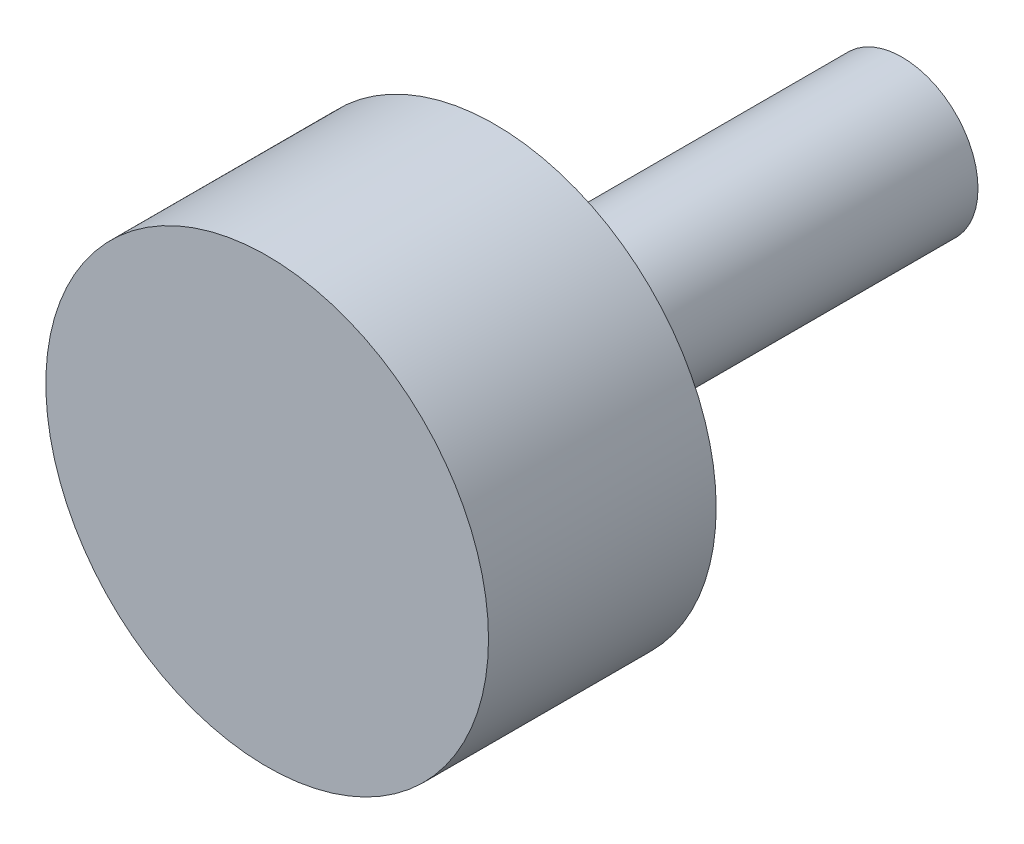
ISO-10303-21;
HEADER;
FILE_DESCRIPTION(('STEP AP214'),'2;1');
FILE_NAME('part.step','',(''),(''),'','','');
FILE_SCHEMA(('AUTOMOTIVE_DESIGN { 1 0 10303 214 1 1 1 1 }'));
ENDSEC;
DATA;
#1=APPLICATION_CONTEXT('core data for automotive mechanical design processes');
#2=APPLICATION_PROTOCOL_DEFINITION('international standard','automotive_design',2000,#1);
#3=PRODUCT_CONTEXT('',#1,'mechanical');
#4=PRODUCT('Part','Part','',(#3));
#5=PRODUCT_RELATED_PRODUCT_CATEGORY('part','',(#4));
#6=PRODUCT_DEFINITION_FORMATION('','',#4);
#7=PRODUCT_DEFINITION_CONTEXT('part definition',#1,'design');
#8=PRODUCT_DEFINITION('design','',#6,#7);
#9=PRODUCT_DEFINITION_SHAPE('','',#8);
#10=(LENGTH_UNIT() NAMED_UNIT(*) SI_UNIT(.MILLI.,.METRE.));
#11=(NAMED_UNIT(*) PLANE_ANGLE_UNIT() SI_UNIT($,.RADIAN.));
#12=(NAMED_UNIT(*) SI_UNIT($,.STERADIAN.) SOLID_ANGLE_UNIT());
#13=UNCERTAINTY_MEASURE_WITH_UNIT(LENGTH_MEASURE(1.E-05),#10,'distance_accuracy_value','');
#14=(GEOMETRIC_REPRESENTATION_CONTEXT(3) GLOBAL_UNCERTAINTY_ASSIGNED_CONTEXT((#13)) GLOBAL_UNIT_ASSIGNED_CONTEXT((#10,
#11,#12)) REPRESENTATION_CONTEXT('',''));
#15=CARTESIAN_POINT('',(0.,0.,0.));
#16=DIRECTION('',(0.,0.,1.));
#17=DIRECTION('',(1.,0.,0.));
#18=AXIS2_PLACEMENT_3D('',#15,#16,#17);
#19=CARTESIAN_POINT('',(0.,0.,32.2));
#20=DIRECTION('',(0.,0.,-1.));
#21=DIRECTION('',(-1.,0.,0.));
#22=AXIS2_PLACEMENT_3D('',#19,#20,#21);
#23=CYLINDRICAL_SURFACE('',#22,6.);
#24=CARTESIAN_POINT('',(0.,0.,32.2));
#25=DIRECTION('',(0.,0.,1.));
#26=DIRECTION('',(1.,0.,0.));
#27=AXIS2_PLACEMENT_3D('',#24,#25,#26);
#28=CIRCLE('',#27,6.);
#29=CARTESIAN_POINT('',(6.,0.,32.2));
#30=VERTEX_POINT('',#29);
#31=EDGE_CURVE('E10',#30,#30,#28,.T.);
#32=ORIENTED_EDGE('',*,*,#31,.F.);
#33=EDGE_LOOP('',(#32));
#34=FACE_BOUND('',#33,.T.);
#35=CARTESIAN_POINT('',(0.,0.,0.));
#36=DIRECTION('',(0.,0.,1.));
#37=DIRECTION('',(1.,0.,0.));
#38=AXIS2_PLACEMENT_3D('',#35,#36,#37);
#39=CIRCLE('',#38,6.);
#40=CARTESIAN_POINT('',(6.,0.,0.));
#41=VERTEX_POINT('',#40);
#42=EDGE_CURVE('E43',#41,#41,#39,.T.);
#43=ORIENTED_EDGE('',*,*,#42,.T.);
#44=EDGE_LOOP('',(#43));
#45=FACE_BOUND('',#44,.T.);
#46=ADVANCED_FACE('F40',(#34,#45),#23,.T.);
#47=CARTESIAN_POINT('',(0.,0.,0.));
#48=DIRECTION('',(0.,0.,1.));
#49=DIRECTION('',(1.,0.,0.));
#50=AXIS2_PLACEMENT_3D('',#47,#48,#49);
#51=PLANE('',#50);
#52=CARTESIAN_POINT('',(0.,0.,0.));
#53=DIRECTION('',(0.,0.,-1.));
#54=DIRECTION('',(-1.,0.,0.));
#55=AXIS2_PLACEMENT_3D('',#52,#53,#54);
#56=CIRCLE('',#55,2.9);
#57=CARTESIAN_POINT('',(-2.9,0.,0.));
#58=VERTEX_POINT('',#57);
#59=EDGE_CURVE('E58',#58,#58,#56,.T.);
#60=ORIENTED_EDGE('',*,*,#59,.F.);
#61=EDGE_LOOP('',(#60));
#62=FACE_BOUND('',#61,.T.);
#63=ORIENTED_EDGE('',*,*,#42,.F.);
#64=EDGE_LOOP('',(#63));
#65=FACE_BOUND('',#64,.T.);
#66=ADVANCED_FACE('F73',(#62,#65),#51,.F.);
#67=CARTESIAN_POINT('',(0.,0.,50.2));
#68=DIRECTION('',(0.,0.,-1.));
#69=DIRECTION('',(-1.,0.,0.));
#70=AXIS2_PLACEMENT_3D('',#67,#68,#69);
#71=CYLINDRICAL_SURFACE('',#70,17.5);
#72=CARTESIAN_POINT('',(0.,0.,50.2));
#73=DIRECTION('',(0.,0.,1.));
#74=DIRECTION('',(1.,0.,0.));
#75=AXIS2_PLACEMENT_3D('',#72,#73,#74);
#76=CIRCLE('',#75,17.5);
#77=CARTESIAN_POINT('',(17.5,0.,50.2));
#78=VERTEX_POINT('',#77);
#79=EDGE_CURVE('E50',#78,#78,#76,.T.);
#80=ORIENTED_EDGE('',*,*,#79,.F.);
#81=EDGE_LOOP('',(#80));
#82=FACE_BOUND('',#81,.T.);
#83=CARTESIAN_POINT('',(0.,0.,32.2));
#84=DIRECTION('',(0.,0.,1.));
#85=DIRECTION('',(1.,0.,0.));
#86=AXIS2_PLACEMENT_3D('',#83,#84,#85);
#87=CIRCLE('',#86,17.5);
#88=CARTESIAN_POINT('',(17.5,0.,32.2));
#89=VERTEX_POINT('',#88);
#90=EDGE_CURVE('E52',#89,#89,#87,.T.);
#91=ORIENTED_EDGE('',*,*,#90,.T.);
#92=EDGE_LOOP('',(#91));
#93=FACE_BOUND('',#92,.T.);
#94=ADVANCED_FACE('F76',(#82,#93),#71,.T.);
#95=CARTESIAN_POINT('',(0.,0.,50.2));
#96=DIRECTION('',(0.,0.,1.));
#97=DIRECTION('',(1.,0.,0.));
#98=AXIS2_PLACEMENT_3D('',#95,#96,#97);
#99=PLANE('',#98);
#100=ORIENTED_EDGE('',*,*,#79,.T.);
#101=EDGE_LOOP('',(#100));
#102=FACE_BOUND('',#101,.T.);
#103=ADVANCED_FACE('F93',(#102),#99,.T.);
#104=CARTESIAN_POINT('',(0.,0.,32.2));
#105=DIRECTION('',(0.,0.,1.));
#106=DIRECTION('',(1.,0.,0.));
#107=AXIS2_PLACEMENT_3D('',#104,#105,#106);
#108=PLANE('',#107);
#109=ORIENTED_EDGE('',*,*,#31,.T.);
#110=EDGE_LOOP('',(#109));
#111=FACE_BOUND('',#110,.T.);
#112=ORIENTED_EDGE('',*,*,#90,.F.);
#113=EDGE_LOOP('',(#112));
#114=FACE_BOUND('',#113,.T.);
#115=ADVANCED_FACE('F69',(#111,#114),#108,.F.);
#116=CARTESIAN_POINT('',(0.,0.,18.));
#117=DIRECTION('',(0.,0.,-1.));
#118=DIRECTION('',(-1.,0.,0.));
#119=AXIS2_PLACEMENT_3D('',#116,#117,#118);
#120=CYLINDRICAL_SURFACE('',#119,2.9);
#121=CARTESIAN_POINT('',(0.,0.,18.));
#122=DIRECTION('',(0.,0.,-1.));
#123=DIRECTION('',(-1.,0.,0.));
#124=AXIS2_PLACEMENT_3D('',#121,#122,#123);
#125=CIRCLE('',#124,2.9);
#126=CARTESIAN_POINT('',(-2.9,0.,18.));
#127=VERTEX_POINT('',#126);
#128=EDGE_CURVE('E55',#127,#127,#125,.T.);
#129=ORIENTED_EDGE('',*,*,#128,.F.);
#130=EDGE_LOOP('',(#129));
#131=FACE_BOUND('',#130,.T.);
#132=ORIENTED_EDGE('',*,*,#59,.T.);
#133=EDGE_LOOP('',(#132));
#134=FACE_BOUND('',#133,.T.);
#135=ADVANCED_FACE('F66',(#131,#134),#120,.F.);
#136=CARTESIAN_POINT('',(0.,0.,18.));
#137=DIRECTION('',(0.,0.,-1.));
#138=DIRECTION('',(-1.,0.,0.));
#139=AXIS2_PLACEMENT_3D('',#136,#137,#138);
#140=PLANE('',#139);
#141=ORIENTED_EDGE('',*,*,#128,.T.);
#142=EDGE_LOOP('',(#141));
#143=FACE_BOUND('',#142,.T.);
#144=ADVANCED_FACE('F64',(#143),#140,.T.);
#145=CLOSED_SHELL('',(#46,#66,#94,#103,#115,#135,#144));
#146=MANIFOLD_SOLID_BREP('B2',#145);
#147=ADVANCED_BREP_SHAPE_REPRESENTATION('',(#18,#146),#14);
#148=SHAPE_DEFINITION_REPRESENTATION(#9,#147);
ENDSEC;
END-ISO-10303-21;
